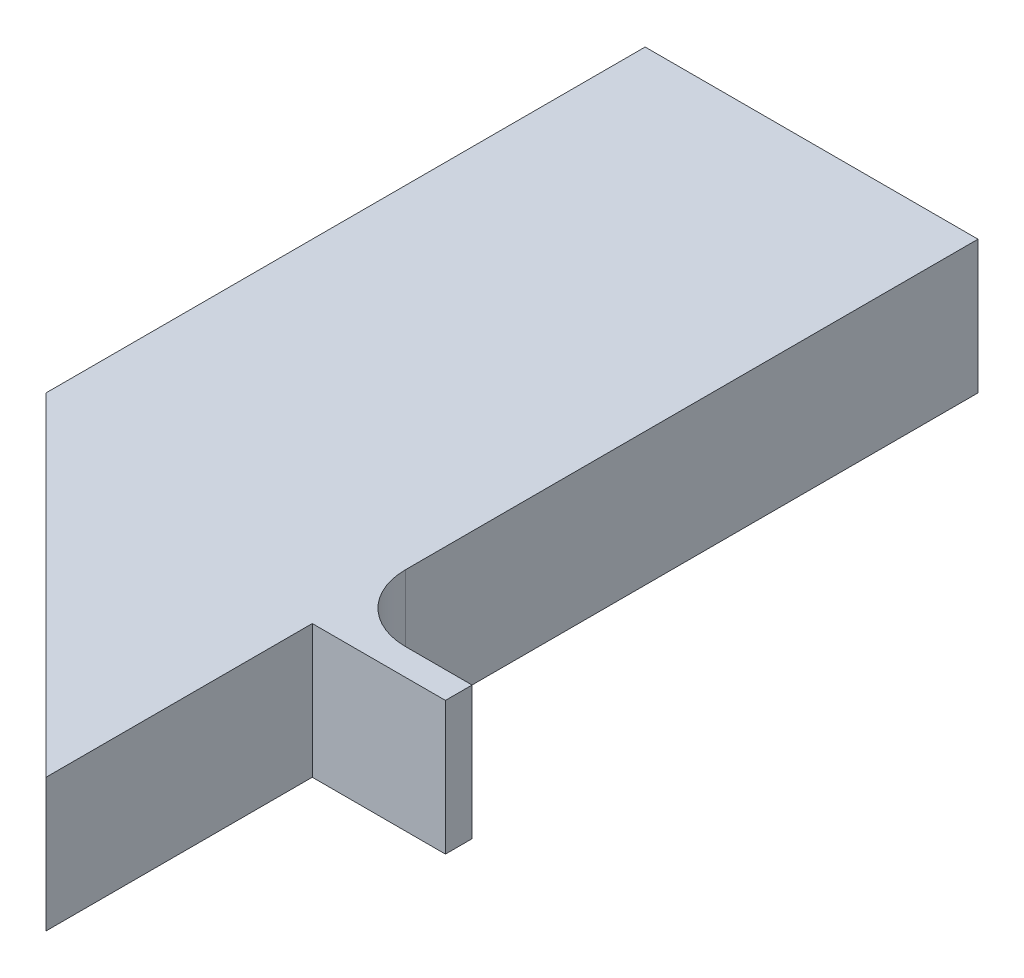
ISO-10303-21;
HEADER;
FILE_DESCRIPTION(('STEP AP214'),'2;1');
FILE_NAME('part.step','',(''),(''),'','','');
FILE_SCHEMA(('AUTOMOTIVE_DESIGN { 1 0 10303 214 1 1 1 1 }'));
ENDSEC;
DATA;
#1=APPLICATION_CONTEXT('core data for automotive mechanical design processes');
#2=APPLICATION_PROTOCOL_DEFINITION('international standard','automotive_design',2000,#1);
#3=PRODUCT_CONTEXT('',#1,'mechanical');
#4=PRODUCT('Part','Part','',(#3));
#5=PRODUCT_RELATED_PRODUCT_CATEGORY('part','',(#4));
#6=PRODUCT_DEFINITION_FORMATION('','',#4);
#7=PRODUCT_DEFINITION_CONTEXT('part definition',#1,'design');
#8=PRODUCT_DEFINITION('design','',#6,#7);
#9=PRODUCT_DEFINITION_SHAPE('','',#8);
#10=(LENGTH_UNIT() NAMED_UNIT(*) SI_UNIT(.MILLI.,.METRE.));
#11=(NAMED_UNIT(*) PLANE_ANGLE_UNIT() SI_UNIT($,.RADIAN.));
#12=(NAMED_UNIT(*) SI_UNIT($,.STERADIAN.) SOLID_ANGLE_UNIT());
#13=UNCERTAINTY_MEASURE_WITH_UNIT(LENGTH_MEASURE(1.E-05),#10,'distance_accuracy_value','');
#14=(GEOMETRIC_REPRESENTATION_CONTEXT(3) GLOBAL_UNCERTAINTY_ASSIGNED_CONTEXT((#13)) GLOBAL_UNIT_ASSIGNED_CONTEXT((#10,
#11,#12)) REPRESENTATION_CONTEXT('',''));
#15=CARTESIAN_POINT('',(0.,0.,0.));
#16=DIRECTION('',(0.,0.,1.));
#17=DIRECTION('',(1.,0.,0.));
#18=AXIS2_PLACEMENT_3D('',#15,#16,#17);
#19=CARTESIAN_POINT('',(0.,20.,-140.));
#20=DIRECTION('',(-1.,0.,0.));
#21=DIRECTION('',(0.,0.,1.));
#22=AXIS2_PLACEMENT_3D('',#19,#20,#21);
#23=PLANE('',#22);
#24=DIRECTION('',(0.,-1.,0.));
#25=VECTOR('',#24,1.);
#26=CARTESIAN_POINT('',(0.,20.,-40.));
#27=LINE('',#26,#25);
#28=CARTESIAN_POINT('',(0.,20.,-40.));
#29=VERTEX_POINT('',#28);
#30=CARTESIAN_POINT('',(0.,0.,-40.));
#31=VERTEX_POINT('',#30);
#32=EDGE_CURVE('E252',#29,#31,#27,.T.);
#33=ORIENTED_EDGE('',*,*,#32,.F.);
#34=DIRECTION('',(0.,0.,-1.));
#35=VECTOR('',#34,1.);
#36=CARTESIAN_POINT('',(0.,20.,-140.));
#37=LINE('',#36,#35);
#38=CARTESIAN_POINT('',(0.,20.,0.));
#39=VERTEX_POINT('',#38);
#40=EDGE_CURVE('E226',#39,#29,#37,.T.);
#41=ORIENTED_EDGE('',*,*,#40,.F.);
#42=DIRECTION('',(0.,-1.,0.));
#43=VECTOR('',#42,1.);
#44=CARTESIAN_POINT('',(0.,20.,0.));
#45=LINE('',#44,#43);
#46=CARTESIAN_POINT('',(0.,0.,0.));
#47=VERTEX_POINT('',#46);
#48=EDGE_CURVE('E195',#39,#47,#45,.T.);
#49=ORIENTED_EDGE('',*,*,#48,.T.);
#50=DIRECTION('',(0.,0.,-1.));
#51=VECTOR('',#50,1.);
#52=CARTESIAN_POINT('',(0.,0.,-140.));
#53=LINE('',#52,#51);
#54=EDGE_CURVE('E212',#47,#31,#53,.T.);
#55=ORIENTED_EDGE('',*,*,#54,.T.);
#56=EDGE_LOOP('',(#33,#41,#49,#55));
#57=FACE_BOUND('',#56,.T.);
#58=ADVANCED_FACE('F41',(#57),#23,.F.);
#59=CARTESIAN_POINT('',(0.,20.,-54.));
#60=VERTEX_POINT('',#59);
#61=CARTESIAN_POINT('',(0.,20.,-140.));
#62=VERTEX_POINT('',#61);
#63=EDGE_CURVE('E230',#60,#62,#37,.T.);
#64=ORIENTED_EDGE('',*,*,#63,.F.);
#65=DIRECTION('',(0.,1.,0.));
#66=VECTOR('',#65,1.);
#67=CARTESIAN_POINT('',(0.,0.,-54.));
#68=LINE('',#67,#66);
#69=CARTESIAN_POINT('',(0.,0.,-54.));
#70=VERTEX_POINT('',#69);
#71=EDGE_CURVE('E63',#60,#70,#68,.F.);
#72=ORIENTED_EDGE('',*,*,#71,.T.);
#73=CARTESIAN_POINT('',(0.,0.,-140.));
#74=VERTEX_POINT('',#73);
#75=EDGE_CURVE('E215',#70,#74,#53,.T.);
#76=ORIENTED_EDGE('',*,*,#75,.T.);
#77=DIRECTION('',(0.,-1.,0.));
#78=VECTOR('',#77,1.);
#79=CARTESIAN_POINT('',(0.,20.,-140.));
#80=LINE('',#79,#78);
#81=EDGE_CURVE('E199',#62,#74,#80,.T.);
#82=ORIENTED_EDGE('',*,*,#81,.F.);
#83=EDGE_LOOP('',(#64,#72,#76,#82));
#84=FACE_BOUND('',#83,.T.);
#85=ADVANCED_FACE('F320',(#84),#23,.F.);
#86=CARTESIAN_POINT('',(-50.,20.,-140.));
#87=DIRECTION('',(1.,0.,0.));
#88=DIRECTION('',(0.,0.,-1.));
#89=AXIS2_PLACEMENT_3D('',#86,#87,#88);
#90=PLANE('',#89);
#91=DIRECTION('',(0.,0.,1.));
#92=VECTOR('',#91,1.);
#93=CARTESIAN_POINT('',(-50.,0.,-140.));
#94=LINE('',#93,#92);
#95=CARTESIAN_POINT('',(-50.,0.,-140.));
#96=VERTEX_POINT('',#95);
#97=CARTESIAN_POINT('',(-50.,0.,-49.9999999999998));
#98=VERTEX_POINT('',#97);
#99=EDGE_CURVE('E219',#96,#98,#94,.T.);
#100=ORIENTED_EDGE('',*,*,#99,.T.);
#101=DIRECTION('',(0.,-1.,0.));
#102=VECTOR('',#101,1.);
#103=CARTESIAN_POINT('',(-50.,20.,-49.9999999999998));
#104=LINE('',#103,#102);
#105=CARTESIAN_POINT('',(-50.,20.,-49.9999999999998));
#106=VERTEX_POINT('',#105);
#107=EDGE_CURVE('E191',#106,#98,#104,.T.);
#108=ORIENTED_EDGE('',*,*,#107,.F.);
#109=DIRECTION('',(0.,0.,1.));
#110=VECTOR('',#109,1.);
#111=CARTESIAN_POINT('',(-50.,20.,-140.));
#112=LINE('',#111,#110);
#113=CARTESIAN_POINT('',(-50.,20.,-140.));
#114=VERTEX_POINT('',#113);
#115=EDGE_CURVE('E211',#114,#106,#112,.T.);
#116=ORIENTED_EDGE('',*,*,#115,.F.);
#117=DIRECTION('',(0.,-1.,0.));
#118=VECTOR('',#117,1.);
#119=CARTESIAN_POINT('',(-50.,20.,-140.));
#120=LINE('',#119,#118);
#121=EDGE_CURVE('E203',#114,#96,#120,.T.);
#122=ORIENTED_EDGE('',*,*,#121,.T.);
#123=EDGE_LOOP('',(#100,#108,#116,#122));
#124=FACE_BOUND('',#123,.T.);
#125=ADVANCED_FACE('F313',(#124),#90,.F.);
#126=CARTESIAN_POINT('',(-50.,20.,-49.9999999999998));
#127=DIRECTION('',(0.707106781186546,0.,-0.707106781186549));
#128=DIRECTION('',(-0.707106781186549,0.,-0.707106781186546));
#129=AXIS2_PLACEMENT_3D('',#126,#127,#128);
#130=PLANE('',#129);
#131=DIRECTION('',(-0.707106781186549,0.,-0.707106781186546));
#132=VECTOR('',#131,1.);
#133=CARTESIAN_POINT('',(-50.,4.,-49.9999999999998));
#134=LINE('',#133,#132);
#135=CARTESIAN_POINT('',(-4.00000000000001,4.,-4.));
#136=VERTEX_POINT('',#135);
#137=CARTESIAN_POINT('',(-46.,4.,-45.9999999999998));
#138=VERTEX_POINT('',#137);
#139=EDGE_CURVE('E184',#136,#138,#134,.T.);
#140=ORIENTED_EDGE('',*,*,#139,.T.);
#141=DIRECTION('',(0.,1.,0.));
#142=VECTOR('',#141,1.);
#143=CARTESIAN_POINT('',(-46.,20.,-45.9999999999998));
#144=LINE('',#143,#142);
#145=CARTESIAN_POINT('',(-46.,16.,-45.9999999999998));
#146=VERTEX_POINT('',#145);
#147=EDGE_CURVE('E171',#138,#146,#144,.T.);
#148=ORIENTED_EDGE('',*,*,#147,.T.);
#149=DIRECTION('',(0.707106781186549,0.,0.707106781186546));
#150=VECTOR('',#149,1.);
#151=CARTESIAN_POINT('',(-50.,16.,-49.9999999999998));
#152=LINE('',#151,#150);
#153=CARTESIAN_POINT('',(-4.,16.,-4.));
#154=VERTEX_POINT('',#153);
#155=EDGE_CURVE('E180',#146,#154,#152,.T.);
#156=ORIENTED_EDGE('',*,*,#155,.T.);
#157=DIRECTION('',(0.,1.,0.));
#158=VECTOR('',#157,1.);
#159=CARTESIAN_POINT('',(-4.00000000000001,20.,-4.));
#160=LINE('',#159,#158);
#161=EDGE_CURVE('E188',#136,#154,#160,.T.);
#162=ORIENTED_EDGE('',*,*,#161,.F.);
#163=EDGE_LOOP('',(#140,#148,#156,#162));
#164=FACE_BOUND('',#163,.T.);
#165=DIRECTION('',(0.707106781186549,0.,0.707106781186546));
#166=VECTOR('',#165,1.);
#167=CARTESIAN_POINT('',(-50.,0.,-49.9999999999998));
#168=LINE('',#167,#166);
#169=EDGE_CURVE('E216',#98,#47,#168,.T.);
#170=ORIENTED_EDGE('',*,*,#169,.T.);
#171=ORIENTED_EDGE('',*,*,#48,.F.);
#172=DIRECTION('',(0.707106781186549,0.,0.707106781186546));
#173=VECTOR('',#172,1.);
#174=CARTESIAN_POINT('',(-50.,20.,-49.9999999999998));
#175=LINE('',#174,#173);
#176=EDGE_CURVE('E231',#106,#39,#175,.T.);
#177=ORIENTED_EDGE('',*,*,#176,.F.);
#178=ORIENTED_EDGE('',*,*,#107,.T.);
#179=EDGE_LOOP('',(#170,#171,#177,#178));
#180=FACE_BOUND('',#179,.T.);
#181=ADVANCED_FACE('F331',(#164,#180),#130,.F.);
#182=CARTESIAN_POINT('',(-50.,20.,-140.));
#183=DIRECTION('',(0.,0.,1.));
#184=DIRECTION('',(1.,0.,0.));
#185=AXIS2_PLACEMENT_3D('',#182,#183,#184);
#186=PLANE('',#185);
#187=DIRECTION('',(-1.,0.,0.));
#188=VECTOR('',#187,1.);
#189=CARTESIAN_POINT('',(-50.,0.,-140.));
#190=LINE('',#189,#188);
#191=EDGE_CURVE('E208',#74,#96,#190,.T.);
#192=ORIENTED_EDGE('',*,*,#191,.T.);
#193=ORIENTED_EDGE('',*,*,#121,.F.);
#194=DIRECTION('',(-1.,0.,0.));
#195=VECTOR('',#194,1.);
#196=CARTESIAN_POINT('',(-50.,20.,-140.));
#197=LINE('',#196,#195);
#198=EDGE_CURVE('E207',#62,#114,#197,.T.);
#199=ORIENTED_EDGE('',*,*,#198,.F.);
#200=ORIENTED_EDGE('',*,*,#81,.T.);
#201=EDGE_LOOP('',(#192,#193,#199,#200));
#202=FACE_BOUND('',#201,.T.);
#203=ADVANCED_FACE('F318',(#202),#186,.F.);
#204=CARTESIAN_POINT('',(0.,20.,0.));
#205=DIRECTION('',(0.,1.,0.));
#206=DIRECTION('',(0.,0.,1.));
#207=AXIS2_PLACEMENT_3D('',#204,#205,#206);
#208=PLANE('',#207);
#209=ORIENTED_EDGE('',*,*,#115,.T.);
#210=ORIENTED_EDGE('',*,*,#176,.T.);
#211=ORIENTED_EDGE('',*,*,#40,.T.);
#212=DIRECTION('',(-1.,0.,0.));
#213=VECTOR('',#212,1.);
#214=CARTESIAN_POINT('',(20.,20.,-40.));
#215=LINE('',#214,#213);
#216=CARTESIAN_POINT('',(20.,20.,-40.));
#217=VERTEX_POINT('',#216);
#218=EDGE_CURVE('E247',#217,#29,#215,.T.);
#219=ORIENTED_EDGE('',*,*,#218,.F.);
#220=DIRECTION('',(0.,0.,1.));
#221=VECTOR('',#220,1.);
#222=CARTESIAN_POINT('',(20.,20.,-40.));
#223=LINE('',#222,#221);
#224=CARTESIAN_POINT('',(20.,20.,-44.));
#225=VERTEX_POINT('',#224);
#226=EDGE_CURVE('E251',#225,#217,#223,.T.);
#227=ORIENTED_EDGE('',*,*,#226,.F.);
#228=DIRECTION('',(-1.,0.,0.));
#229=VECTOR('',#228,1.);
#230=CARTESIAN_POINT('',(20.,20.,-44.));
#231=LINE('',#230,#229);
#232=CARTESIAN_POINT('',(10.,20.,-44.));
#233=VERTEX_POINT('',#232);
#234=EDGE_CURVE('E244',#225,#233,#231,.T.);
#235=ORIENTED_EDGE('',*,*,#234,.T.);
#236=CARTESIAN_POINT('',(10.,20.,-54.));
#237=DIRECTION('',(0.,1.,0.));
#238=DIRECTION('',(0.,0.,1.));
#239=AXIS2_PLACEMENT_3D('',#236,#237,#238);
#240=CIRCLE('',#239,10.);
#241=EDGE_CURVE('E50',#233,#60,#240,.F.);
#242=ORIENTED_EDGE('',*,*,#241,.T.);
#243=ORIENTED_EDGE('',*,*,#63,.T.);
#244=ORIENTED_EDGE('',*,*,#198,.T.);
#245=EDGE_LOOP('',(#209,#210,#211,#219,#227,#235,#242,#243,#244));
#246=FACE_BOUND('',#245,.T.);
#247=ADVANCED_FACE('F304',(#246),#208,.T.);
#248=CARTESIAN_POINT('',(0.,0.,0.));
#249=DIRECTION('',(0.,1.,0.));
#250=DIRECTION('',(0.,0.,1.));
#251=AXIS2_PLACEMENT_3D('',#248,#249,#250);
#252=PLANE('',#251);
#253=CARTESIAN_POINT('',(-25.,0.,-54.));
#254=DIRECTION('',(0.,-1.,0.));
#255=DIRECTION('',(0.,0.,-1.));
#256=AXIS2_PLACEMENT_3D('',#253,#254,#255);
#257=CIRCLE('',#256,11.);
#258=CARTESIAN_POINT('',(-25.,0.,-65.));
#259=VERTEX_POINT('',#258);
#260=EDGE_CURVE('E160',#259,#259,#257,.T.);
#261=ORIENTED_EDGE('',*,*,#260,.F.);
#262=EDGE_LOOP('',(#261));
#263=FACE_BOUND('',#262,.T.);
#264=CARTESIAN_POINT('',(-25.,0.,-114.));
#265=DIRECTION('',(0.,-1.,0.));
#266=DIRECTION('',(0.,0.,-1.));
#267=AXIS2_PLACEMENT_3D('',#264,#265,#266);
#268=CIRCLE('',#267,11.);
#269=CARTESIAN_POINT('',(-25.,0.,-125.));
#270=VERTEX_POINT('',#269);
#271=EDGE_CURVE('E287',#270,#270,#268,.T.);
#272=ORIENTED_EDGE('',*,*,#271,.F.);
#273=EDGE_LOOP('',(#272));
#274=FACE_BOUND('',#273,.T.);
#275=ORIENTED_EDGE('',*,*,#99,.F.);
#276=ORIENTED_EDGE('',*,*,#191,.F.);
#277=ORIENTED_EDGE('',*,*,#75,.F.);
#278=CARTESIAN_POINT('',(10.,0.,-54.));
#279=DIRECTION('',(0.,1.,0.));
#280=DIRECTION('',(0.,0.,1.));
#281=AXIS2_PLACEMENT_3D('',#278,#279,#280);
#282=CIRCLE('',#281,10.);
#283=CARTESIAN_POINT('',(10.,0.,-44.));
#284=VERTEX_POINT('',#283);
#285=EDGE_CURVE('E12',#70,#284,#282,.T.);
#286=ORIENTED_EDGE('',*,*,#285,.T.);
#287=DIRECTION('',(-1.,0.,0.));
#288=VECTOR('',#287,1.);
#289=CARTESIAN_POINT('',(20.,0.,-44.));
#290=LINE('',#289,#288);
#291=CARTESIAN_POINT('',(20.,0.,-44.));
#292=VERTEX_POINT('',#291);
#293=EDGE_CURVE('E240',#292,#284,#290,.T.);
#294=ORIENTED_EDGE('',*,*,#293,.F.);
#295=DIRECTION('',(0.,0.,-1.));
#296=VECTOR('',#295,1.);
#297=CARTESIAN_POINT('',(20.,0.,-40.));
#298=LINE('',#297,#296);
#299=CARTESIAN_POINT('',(20.,0.,-40.));
#300=VERTEX_POINT('',#299);
#301=EDGE_CURVE('E263',#300,#292,#298,.T.);
#302=ORIENTED_EDGE('',*,*,#301,.F.);
#303=DIRECTION('',(-1.,0.,0.));
#304=VECTOR('',#303,1.);
#305=CARTESIAN_POINT('',(20.,0.,-40.));
#306=LINE('',#305,#304);
#307=EDGE_CURVE('E223',#300,#31,#306,.T.);
#308=ORIENTED_EDGE('',*,*,#307,.T.);
#309=ORIENTED_EDGE('',*,*,#54,.F.);
#310=ORIENTED_EDGE('',*,*,#169,.F.);
#311=EDGE_LOOP('',(#275,#276,#277,#286,#294,#302,#308,#309,#310));
#312=FACE_BOUND('',#311,.T.);
#313=ADVANCED_FACE('F300',(#263,#274,#312),#252,.F.);
#314=CARTESIAN_POINT('',(20.,20.,-40.));
#315=DIRECTION('',(0.,0.,-1.));
#316=DIRECTION('',(-1.,0.,0.));
#317=AXIS2_PLACEMENT_3D('',#314,#315,#316);
#318=PLANE('',#317);
#319=ORIENTED_EDGE('',*,*,#32,.T.);
#320=ORIENTED_EDGE('',*,*,#307,.F.);
#321=DIRECTION('',(0.,-1.,0.));
#322=VECTOR('',#321,1.);
#323=CARTESIAN_POINT('',(20.,20.,-40.));
#324=LINE('',#323,#322);
#325=EDGE_CURVE('E256',#217,#300,#324,.T.);
#326=ORIENTED_EDGE('',*,*,#325,.F.);
#327=ORIENTED_EDGE('',*,*,#218,.T.);
#328=EDGE_LOOP('',(#319,#320,#326,#327));
#329=FACE_BOUND('',#328,.T.);
#330=ADVANCED_FACE('F303',(#329),#318,.F.);
#331=CARTESIAN_POINT('',(20.,20.,-44.));
#332=DIRECTION('',(0.,0.,1.));
#333=DIRECTION('',(1.,0.,0.));
#334=AXIS2_PLACEMENT_3D('',#331,#332,#333);
#335=PLANE('',#334);
#336=ORIENTED_EDGE('',*,*,#293,.T.);
#337=DIRECTION('',(0.,1.,0.));
#338=VECTOR('',#337,1.);
#339=CARTESIAN_POINT('',(10.,20.,-44.));
#340=LINE('',#339,#338);
#341=EDGE_CURVE('E165',#284,#233,#340,.T.);
#342=ORIENTED_EDGE('',*,*,#341,.T.);
#343=ORIENTED_EDGE('',*,*,#234,.F.);
#344=DIRECTION('',(0.,1.,0.));
#345=VECTOR('',#344,1.);
#346=CARTESIAN_POINT('',(20.,20.,-44.));
#347=LINE('',#346,#345);
#348=EDGE_CURVE('E260',#292,#225,#347,.T.);
#349=ORIENTED_EDGE('',*,*,#348,.F.);
#350=EDGE_LOOP('',(#336,#342,#343,#349));
#351=FACE_BOUND('',#350,.T.);
#352=ADVANCED_FACE('F390',(#351),#335,.F.);
#353=CARTESIAN_POINT('',(20.,0.,0.));
#354=DIRECTION('',(1.,0.,0.));
#355=DIRECTION('',(0.,0.,-1.));
#356=AXIS2_PLACEMENT_3D('',#353,#354,#355);
#357=PLANE('',#356);
#358=ORIENTED_EDGE('',*,*,#325,.T.);
#359=ORIENTED_EDGE('',*,*,#301,.T.);
#360=ORIENTED_EDGE('',*,*,#348,.T.);
#361=ORIENTED_EDGE('',*,*,#226,.T.);
#362=EDGE_LOOP('',(#358,#359,#360,#361));
#363=FACE_BOUND('',#362,.T.);
#364=ADVANCED_FACE('F346',(#363),#357,.T.);
#365=CARTESIAN_POINT('',(47.5394572960187,16.,-45.9999999999998));
#366=DIRECTION('',(0.,0.,-1.));
#367=DIRECTION('',(-1.,0.,0.));
#368=AXIS2_PLACEMENT_3D('',#365,#366,#367);
#369=PLANE('',#368);
#370=DIRECTION('',(-1.,0.,0.));
#371=VECTOR('',#370,1.);
#372=CARTESIAN_POINT('',(47.5394572960187,8.,-45.9999999999998));
#373=LINE('',#372,#371);
#374=CARTESIAN_POINT('',(-17.4501655647295,8.,-45.9999999999998));
#375=VERTEX_POINT('',#374);
#376=CARTESIAN_POINT('',(-32.5498344352705,8.,-45.9999999999998));
#377=VERTEX_POINT('',#376);
#378=EDGE_CURVE('E158',#375,#377,#373,.T.);
#379=ORIENTED_EDGE('',*,*,#378,.F.);
#380=DIRECTION('',(0.,-1.,0.));
#381=VECTOR('',#380,1.);
#382=CARTESIAN_POINT('',(-17.4501655647295,8.,-45.9999999999998));
#383=LINE('',#382,#381);
#384=CARTESIAN_POINT('',(-17.4501655647295,4.,-45.9999999999998));
#385=VERTEX_POINT('',#384);
#386=EDGE_CURVE('E141',#375,#385,#383,.T.);
#387=ORIENTED_EDGE('',*,*,#386,.T.);
#388=DIRECTION('',(-1.,0.,0.));
#389=VECTOR('',#388,1.);
#390=CARTESIAN_POINT('',(47.5394572960187,4.,-45.9999999999998));
#391=LINE('',#390,#389);
#392=CARTESIAN_POINT('',(-4.,4.,-45.9999999999998));
#393=VERTEX_POINT('',#392);
#394=EDGE_CURVE('E272',#393,#385,#391,.T.);
#395=ORIENTED_EDGE('',*,*,#394,.F.);
#396=DIRECTION('',(0.,1.,0.));
#397=VECTOR('',#396,1.);
#398=CARTESIAN_POINT('',(-4.,16.,-45.9999999999998));
#399=LINE('',#398,#397);
#400=CARTESIAN_POINT('',(-4.,16.,-45.9999999999998));
#401=VERTEX_POINT('',#400);
#402=EDGE_CURVE('E271',#393,#401,#399,.T.);
#403=ORIENTED_EDGE('',*,*,#402,.T.);
#404=DIRECTION('',(-1.,0.,0.));
#405=VECTOR('',#404,1.);
#406=CARTESIAN_POINT('',(47.5394572960187,16.,-45.9999999999998));
#407=LINE('',#406,#405);
#408=EDGE_CURVE('E275',#401,#146,#407,.T.);
#409=ORIENTED_EDGE('',*,*,#408,.T.);
#410=ORIENTED_EDGE('',*,*,#147,.F.);
#411=CARTESIAN_POINT('',(-32.5498344352705,4.,-45.9999999999998));
#412=VERTEX_POINT('',#411);
#413=EDGE_CURVE('E153',#412,#138,#391,.T.);
#414=ORIENTED_EDGE('',*,*,#413,.F.);
#415=DIRECTION('',(0.,-1.,0.));
#416=VECTOR('',#415,1.);
#417=CARTESIAN_POINT('',(-32.5498344352705,8.,-45.9999999999998));
#418=LINE('',#417,#416);
#419=EDGE_CURVE('E154',#412,#377,#418,.F.);
#420=ORIENTED_EDGE('',*,*,#419,.T.);
#421=EDGE_LOOP('',(#379,#387,#395,#403,#409,#410,#414,#420));
#422=FACE_BOUND('',#421,.T.);
#423=ADVANCED_FACE('F162',(#422),#369,.F.);
#424=CARTESIAN_POINT('',(47.5394572960187,16.,-45.9999999999998));
#425=DIRECTION('',(0.,1.,0.));
#426=DIRECTION('',(0.,0.,1.));
#427=AXIS2_PLACEMENT_3D('',#424,#425,#426);
#428=PLANE('',#427);
#429=ORIENTED_EDGE('',*,*,#408,.F.);
#430=DIRECTION('',(0.,0.,1.));
#431=VECTOR('',#430,1.);
#432=CARTESIAN_POINT('',(-4.,16.,-45.9999999999998));
#433=LINE('',#432,#431);
#434=EDGE_CURVE('E279',#401,#154,#433,.T.);
#435=ORIENTED_EDGE('',*,*,#434,.T.);
#436=ORIENTED_EDGE('',*,*,#155,.F.);
#437=EDGE_LOOP('',(#429,#435,#436));
#438=FACE_BOUND('',#437,.T.);
#439=ADVANCED_FACE('F338',(#438),#428,.F.);
#440=CARTESIAN_POINT('',(47.5394572960187,4.,-45.9999999999998));
#441=DIRECTION('',(0.,-1.,0.));
#442=DIRECTION('',(0.,0.,-1.));
#443=AXIS2_PLACEMENT_3D('',#440,#441,#442);
#444=PLANE('',#443);
#445=ORIENTED_EDGE('',*,*,#394,.T.);
#446=CARTESIAN_POINT('',(-25.,4.,-54.));
#447=DIRECTION('',(0.,-1.,0.));
#448=DIRECTION('',(0.,0.,-1.));
#449=AXIS2_PLACEMENT_3D('',#446,#447,#448);
#450=CIRCLE('',#449,11.);
#451=EDGE_CURVE('E147',#385,#412,#450,.T.);
#452=ORIENTED_EDGE('',*,*,#451,.T.);
#453=ORIENTED_EDGE('',*,*,#413,.T.);
#454=ORIENTED_EDGE('',*,*,#139,.F.);
#455=DIRECTION('',(0.,0.,-1.));
#456=VECTOR('',#455,1.);
#457=CARTESIAN_POINT('',(-4.,4.,-45.9999999999998));
#458=LINE('',#457,#456);
#459=EDGE_CURVE('E257',#136,#393,#458,.T.);
#460=ORIENTED_EDGE('',*,*,#459,.T.);
#461=EDGE_LOOP('',(#445,#452,#453,#454,#460));
#462=FACE_BOUND('',#461,.T.);
#463=ADVANCED_FACE('F327',(#462),#444,.F.);
#464=CARTESIAN_POINT('',(-4.,20.,-140.));
#465=DIRECTION('',(-1.,0.,0.));
#466=DIRECTION('',(0.,0.,1.));
#467=AXIS2_PLACEMENT_3D('',#464,#465,#466);
#468=PLANE('',#467);
#469=ORIENTED_EDGE('',*,*,#161,.T.);
#470=ORIENTED_EDGE('',*,*,#434,.F.);
#471=ORIENTED_EDGE('',*,*,#402,.F.);
#472=ORIENTED_EDGE('',*,*,#459,.F.);
#473=EDGE_LOOP('',(#469,#470,#471,#472));
#474=FACE_BOUND('',#473,.T.);
#475=ADVANCED_FACE('F335',(#474),#468,.T.);
#476=CARTESIAN_POINT('',(-25.,8.,-54.));
#477=DIRECTION('',(0.,-1.,0.));
#478=DIRECTION('',(0.,0.,-1.));
#479=AXIS2_PLACEMENT_3D('',#476,#477,#478);
#480=PLANE('',#479);
#481=ORIENTED_EDGE('',*,*,#378,.T.);
#482=CARTESIAN_POINT('',(-25.,8.,-54.));
#483=DIRECTION('',(0.,-1.,0.));
#484=DIRECTION('',(0.,0.,-1.));
#485=AXIS2_PLACEMENT_3D('',#482,#483,#484);
#486=CIRCLE('',#485,11.);
#487=EDGE_CURVE('E144',#377,#375,#486,.T.);
#488=ORIENTED_EDGE('',*,*,#487,.T.);
#489=EDGE_LOOP('',(#481,#488));
#490=FACE_BOUND('',#489,.T.);
#491=ADVANCED_FACE('F157',(#490),#480,.T.);
#492=CARTESIAN_POINT('',(-25.,8.,-54.));
#493=DIRECTION('',(0.,-1.,0.));
#494=DIRECTION('',(0.,0.,-1.));
#495=AXIS2_PLACEMENT_3D('',#492,#493,#494);
#496=CYLINDRICAL_SURFACE('',#495,11.);
#497=ORIENTED_EDGE('',*,*,#260,.T.);
#498=EDGE_LOOP('',(#497));
#499=FACE_BOUND('',#498,.T.);
#500=ORIENTED_EDGE('',*,*,#487,.F.);
#501=ORIENTED_EDGE('',*,*,#419,.F.);
#502=ORIENTED_EDGE('',*,*,#451,.F.);
#503=ORIENTED_EDGE('',*,*,#386,.F.);
#504=EDGE_LOOP('',(#500,#501,#502,#503));
#505=FACE_BOUND('',#504,.T.);
#506=ADVANCED_FACE('F143',(#499,#505),#496,.F.);
#507=CARTESIAN_POINT('',(-25.,8.,-114.));
#508=DIRECTION('',(0.,-1.,0.));
#509=DIRECTION('',(0.,0.,-1.));
#510=AXIS2_PLACEMENT_3D('',#507,#508,#509);
#511=CYLINDRICAL_SURFACE('',#510,11.);
#512=CARTESIAN_POINT('',(-25.,8.,-114.));
#513=DIRECTION('',(0.,-1.,0.));
#514=DIRECTION('',(0.,0.,-1.));
#515=AXIS2_PLACEMENT_3D('',#512,#513,#514);
#516=CIRCLE('',#515,11.);
#517=CARTESIAN_POINT('',(-25.,8.,-125.));
#518=VERTEX_POINT('',#517);
#519=EDGE_CURVE('E291',#518,#518,#516,.T.);
#520=ORIENTED_EDGE('',*,*,#519,.F.);
#521=EDGE_LOOP('',(#520));
#522=FACE_BOUND('',#521,.T.);
#523=ORIENTED_EDGE('',*,*,#271,.T.);
#524=EDGE_LOOP('',(#523));
#525=FACE_BOUND('',#524,.T.);
#526=ADVANCED_FACE('F437',(#522,#525),#511,.F.);
#527=CARTESIAN_POINT('',(-25.,8.,-114.));
#528=DIRECTION('',(0.,-1.,0.));
#529=DIRECTION('',(0.,0.,-1.));
#530=AXIS2_PLACEMENT_3D('',#527,#528,#529);
#531=PLANE('',#530);
#532=ORIENTED_EDGE('',*,*,#519,.T.);
#533=EDGE_LOOP('',(#532));
#534=FACE_BOUND('',#533,.T.);
#535=ADVANCED_FACE('F446',(#534),#531,.T.);
#536=CARTESIAN_POINT('',(10.,20.,-54.));
#537=DIRECTION('',(0.,-1.,0.));
#538=DIRECTION('',(0.,0.,-1.));
#539=AXIS2_PLACEMENT_3D('',#536,#537,#538);
#540=CYLINDRICAL_SURFACE('',#539,10.);
#541=ORIENTED_EDGE('',*,*,#285,.F.);
#542=ORIENTED_EDGE('',*,*,#71,.F.);
#543=ORIENTED_EDGE('',*,*,#241,.F.);
#544=ORIENTED_EDGE('',*,*,#341,.F.);
#545=EDGE_LOOP('',(#541,#542,#543,#544));
#546=FACE_BOUND('',#545,.T.);
#547=ADVANCED_FACE('F43',(#546),#540,.F.);
#548=CLOSED_SHELL('',(#58,#85,#125,#181,#203,#247,#313,#330,#352,#364,#423,#439,#463,#475,#491,
#506,#526,#535,#547));
#549=MANIFOLD_SOLID_BREP('B2',#548);
#550=ADVANCED_BREP_SHAPE_REPRESENTATION('',(#18,#549),#14);
#551=SHAPE_DEFINITION_REPRESENTATION(#9,#550);
ENDSEC;
END-ISO-10303-21;
